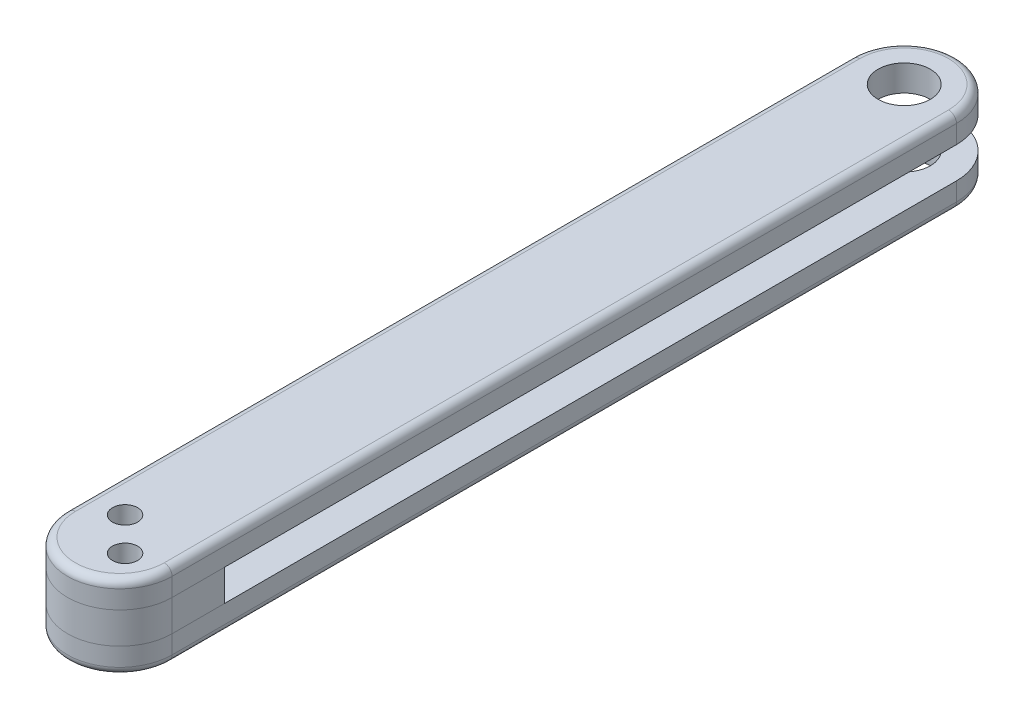
ISO-10303-21;
HEADER;
FILE_DESCRIPTION(('STEP AP214'),'2;1');
FILE_NAME('part.step','',(''),(''),'','','');
FILE_SCHEMA(('AUTOMOTIVE_DESIGN { 1 0 10303 214 1 1 1 1 }'));
ENDSEC;
DATA;
#1=APPLICATION_CONTEXT('core data for automotive mechanical design processes');
#2=APPLICATION_PROTOCOL_DEFINITION('international standard','automotive_design',2000,#1);
#3=PRODUCT_CONTEXT('',#1,'mechanical');
#4=PRODUCT('Part','Part','',(#3));
#5=PRODUCT_RELATED_PRODUCT_CATEGORY('part','',(#4));
#6=PRODUCT_DEFINITION_FORMATION('','',#4);
#7=PRODUCT_DEFINITION_CONTEXT('part definition',#1,'design');
#8=PRODUCT_DEFINITION('design','',#6,#7);
#9=PRODUCT_DEFINITION_SHAPE('','',#8);
#10=(LENGTH_UNIT() NAMED_UNIT(*) SI_UNIT(.MILLI.,.METRE.));
#11=(NAMED_UNIT(*) PLANE_ANGLE_UNIT() SI_UNIT($,.RADIAN.));
#12=(NAMED_UNIT(*) SI_UNIT($,.STERADIAN.) SOLID_ANGLE_UNIT());
#13=UNCERTAINTY_MEASURE_WITH_UNIT(LENGTH_MEASURE(1.E-05),#10,'distance_accuracy_value','');
#14=(GEOMETRIC_REPRESENTATION_CONTEXT(3) GLOBAL_UNCERTAINTY_ASSIGNED_CONTEXT((#13)) GLOBAL_UNIT_ASSIGNED_CONTEXT((#10,
#11,#12)) REPRESENTATION_CONTEXT('',''));
#15=CARTESIAN_POINT('',(0.,0.,0.));
#16=DIRECTION('',(0.,0.,1.));
#17=DIRECTION('',(1.,0.,0.));
#18=AXIS2_PLACEMENT_3D('',#15,#16,#17);
#19=CARTESIAN_POINT('',(-5.,-1.5,0.));
#20=DIRECTION('',(0.,-1.,0.));
#21=DIRECTION('',(0.,0.,-1.));
#22=AXIS2_PLACEMENT_3D('',#19,#20,#21);
#23=PLANE('',#22);
#24=DIRECTION('',(0.,0.,1.));
#25=VECTOR('',#24,1.);
#26=CARTESIAN_POINT('',(4.99999999999997,-1.5,0.));
#27=LINE('',#26,#25);
#28=CARTESIAN_POINT('',(4.99999999999999,-1.50000000002137,32.5));
#29=VERTEX_POINT('',#28);
#30=CARTESIAN_POINT('',(4.99999999999999,-1.5,37.5));
#31=VERTEX_POINT('',#30);
#32=EDGE_CURVE('E113',#29,#31,#27,.T.);
#33=ORIENTED_EDGE('',*,*,#32,.T.);
#34=CARTESIAN_POINT('',(0.,-1.5,37.5));
#35=DIRECTION('',(0.,-1.,0.));
#36=DIRECTION('',(0.,0.,-1.));
#37=AXIS2_PLACEMENT_3D('',#34,#35,#36);
#38=CIRCLE('',#37,4.99999999999998);
#39=CARTESIAN_POINT('',(-4.99999999999998,-1.5,37.5));
#40=VERTEX_POINT('',#39);
#41=EDGE_CURVE('E98',#31,#40,#38,.T.);
#42=ORIENTED_EDGE('',*,*,#41,.T.);
#43=DIRECTION('',(0.,0.,-1.));
#44=VECTOR('',#43,1.);
#45=CARTESIAN_POINT('',(-5.,-1.5,-37.5));
#46=LINE('',#45,#44);
#47=CARTESIAN_POINT('',(-4.99999999999545,-1.50000000002137,32.5));
#48=VERTEX_POINT('',#47);
#49=EDGE_CURVE('E132',#40,#48,#46,.T.);
#50=ORIENTED_EDGE('',*,*,#49,.T.);
#51=DIRECTION('',(-1.,0.,0.));
#52=VECTOR('',#51,1.);
#53=CARTESIAN_POINT('',(400000.,-1.50000000002137,32.5));
#54=LINE('',#53,#52);
#55=EDGE_CURVE('E59',#29,#48,#54,.T.);
#56=ORIENTED_EDGE('',*,*,#55,.F.);
#57=EDGE_LOOP('',(#33,#42,#50,#56));
#58=FACE_BOUND('',#57,.T.);
#59=CARTESIAN_POINT('',(1.59099025766973,-1.5,38.5909902576697));
#60=DIRECTION('',(0.,-1.,0.));
#61=DIRECTION('',(0.,0.,-1.));
#62=AXIS2_PLACEMENT_3D('',#59,#60,#61);
#63=CIRCLE('',#62,1.2);
#64=CARTESIAN_POINT('',(1.59099025766973,-1.5,37.3909902576697));
#65=VERTEX_POINT('',#64);
#66=EDGE_CURVE('E117',#65,#65,#63,.F.);
#67=ORIENTED_EDGE('',*,*,#66,.T.);
#68=EDGE_LOOP('',(#67));
#69=FACE_BOUND('',#68,.T.);
#70=CARTESIAN_POINT('',(-1.59099025766973,-1.5,35.4090097423302));
#71=DIRECTION('',(0.,-1.,0.));
#72=DIRECTION('',(0.,0.,-1.));
#73=AXIS2_PLACEMENT_3D('',#70,#71,#72);
#74=CIRCLE('',#73,1.2);
#75=CARTESIAN_POINT('',(-1.59099025766973,-1.5,34.2090097423302));
#76=VERTEX_POINT('',#75);
#77=EDGE_CURVE('E127',#76,#76,#74,.F.);
#78=ORIENTED_EDGE('',*,*,#77,.T.);
#79=EDGE_LOOP('',(#78));
#80=FACE_BOUND('',#79,.T.);
#81=ADVANCED_FACE('F55',(#58,#69,#80),#23,.T.);
#82=CARTESIAN_POINT('',(-5.,1.5,0.));
#83=DIRECTION('',(0.,1.,0.));
#84=DIRECTION('',(0.,0.,1.));
#85=AXIS2_PLACEMENT_3D('',#82,#83,#84);
#86=PLANE('',#85);
#87=CARTESIAN_POINT('',(0.,1.5,37.5));
#88=DIRECTION('',(0.,1.,0.));
#89=DIRECTION('',(0.,0.,1.));
#90=AXIS2_PLACEMENT_3D('',#87,#88,#89);
#91=CIRCLE('',#90,4.99999999999998);
#92=CARTESIAN_POINT('',(-4.99999999999998,1.5,37.5));
#93=VERTEX_POINT('',#92);
#94=CARTESIAN_POINT('',(4.99999999999999,1.5,37.5));
#95=VERTEX_POINT('',#94);
#96=EDGE_CURVE('E96',#93,#95,#91,.T.);
#97=ORIENTED_EDGE('',*,*,#96,.T.);
#98=DIRECTION('',(0.,0.,-1.));
#99=VECTOR('',#98,1.);
#100=CARTESIAN_POINT('',(4.99999999999997,1.5,-37.5));
#101=LINE('',#100,#99);
#102=CARTESIAN_POINT('',(4.99999999999545,1.50000000002137,32.5));
#103=VERTEX_POINT('',#102);
#104=EDGE_CURVE('E109',#95,#103,#101,.T.);
#105=ORIENTED_EDGE('',*,*,#104,.T.);
#106=DIRECTION('',(1.,0.,0.));
#107=VECTOR('',#106,1.);
#108=CARTESIAN_POINT('',(400000.,1.50000000002137,32.5));
#109=LINE('',#108,#107);
#110=CARTESIAN_POINT('',(-4.99999999999545,1.50000000002137,32.5));
#111=VERTEX_POINT('',#110);
#112=EDGE_CURVE('E65',#111,#103,#109,.T.);
#113=ORIENTED_EDGE('',*,*,#112,.F.);
#114=DIRECTION('',(0.,0.,1.));
#115=VECTOR('',#114,1.);
#116=CARTESIAN_POINT('',(-5.,1.5,-37.5));
#117=LINE('',#116,#115);
#118=EDGE_CURVE('E112',#111,#93,#117,.T.);
#119=ORIENTED_EDGE('',*,*,#118,.T.);
#120=EDGE_LOOP('',(#97,#105,#113,#119));
#121=FACE_BOUND('',#120,.T.);
#122=CARTESIAN_POINT('',(1.59099025766973,1.5,38.5909902576697));
#123=DIRECTION('',(0.,1.,0.));
#124=DIRECTION('',(0.,0.,1.));
#125=AXIS2_PLACEMENT_3D('',#122,#123,#124);
#126=CIRCLE('',#125,1.2);
#127=CARTESIAN_POINT('',(1.59099025766973,1.5,39.7909902576697));
#128=VERTEX_POINT('',#127);
#129=EDGE_CURVE('E121',#128,#128,#126,.F.);
#130=ORIENTED_EDGE('',*,*,#129,.T.);
#131=EDGE_LOOP('',(#130));
#132=FACE_BOUND('',#131,.T.);
#133=CARTESIAN_POINT('',(-1.59099025766973,1.5,35.4090097423302));
#134=DIRECTION('',(0.,1.,0.));
#135=DIRECTION('',(0.,0.,1.));
#136=AXIS2_PLACEMENT_3D('',#133,#134,#135);
#137=CIRCLE('',#136,1.2);
#138=CARTESIAN_POINT('',(-1.59099025766973,1.5,36.6090097423302));
#139=VERTEX_POINT('',#138);
#140=EDGE_CURVE('E128',#139,#139,#137,.F.);
#141=ORIENTED_EDGE('',*,*,#140,.T.);
#142=EDGE_LOOP('',(#141));
#143=FACE_BOUND('',#142,.T.);
#144=ADVANCED_FACE('F107',(#121,#132,#143),#86,.T.);
#145=CARTESIAN_POINT('',(-1.59099025766973,-4.,35.4090097423302));
#146=DIRECTION('',(0.,-1.,0.));
#147=DIRECTION('',(0.,0.,-1.));
#148=AXIS2_PLACEMENT_3D('',#145,#146,#147);
#149=CYLINDRICAL_SURFACE('',#148,1.2);
#150=ORIENTED_EDGE('',*,*,#140,.F.);
#151=EDGE_LOOP('',(#150));
#152=FACE_BOUND('',#151,.T.);
#153=ORIENTED_EDGE('',*,*,#77,.F.);
#154=EDGE_LOOP('',(#153));
#155=FACE_BOUND('',#154,.T.);
#156=ADVANCED_FACE('F149',(#152,#155),#149,.F.);
#157=CARTESIAN_POINT('',(1.59099025766973,-4.,38.5909902576697));
#158=DIRECTION('',(0.,-1.,0.));
#159=DIRECTION('',(0.,0.,-1.));
#160=AXIS2_PLACEMENT_3D('',#157,#158,#159);
#161=CYLINDRICAL_SURFACE('',#160,1.2);
#162=ORIENTED_EDGE('',*,*,#129,.F.);
#163=EDGE_LOOP('',(#162));
#164=FACE_BOUND('',#163,.T.);
#165=ORIENTED_EDGE('',*,*,#66,.F.);
#166=EDGE_LOOP('',(#165));
#167=FACE_BOUND('',#166,.T.);
#168=ADVANCED_FACE('F151',(#164,#167),#161,.F.);
#169=CARTESIAN_POINT('',(5.00000000000001,-5.01928464870704,32.5));
#170=DIRECTION('',(0.,0.,1.));
#171=DIRECTION('',(1.,0.,0.));
#172=AXIS2_PLACEMENT_3D('',#169,#170,#171);
#173=PLANE('',#172);
#174=ORIENTED_EDGE('',*,*,#55,.T.);
#175=DIRECTION('',(0.,1.,0.));
#176=VECTOR('',#175,1.);
#177=CARTESIAN_POINT('',(-4.99999999999545,-291595.6,32.5));
#178=LINE('',#177,#176);
#179=EDGE_CURVE('E12',#48,#111,#178,.T.);
#180=ORIENTED_EDGE('',*,*,#179,.T.);
#181=ORIENTED_EDGE('',*,*,#112,.T.);
#182=DIRECTION('',(0.,-1.,0.));
#183=VECTOR('',#182,1.);
#184=CARTESIAN_POINT('',(4.99999999999545,-291595.6,32.5));
#185=LINE('',#184,#183);
#186=EDGE_CURVE('E116',#103,#29,#185,.T.);
#187=ORIENTED_EDGE('',*,*,#186,.T.);
#188=EDGE_LOOP('',(#174,#180,#181,#187));
#189=FACE_BOUND('',#188,.T.);
#190=ADVANCED_FACE('F141',(#189),#173,.F.);
#191=CARTESIAN_POINT('',(4.99999999999997,4.,-37.5));
#192=DIRECTION('',(-1.,0.,0.));
#193=DIRECTION('',(0.,0.,1.));
#194=AXIS2_PLACEMENT_3D('',#191,#192,#193);
#195=PLANE('',#194);
#196=ORIENTED_EDGE('',*,*,#32,.F.);
#197=ORIENTED_EDGE('',*,*,#186,.F.);
#198=ORIENTED_EDGE('',*,*,#104,.F.);
#199=DIRECTION('',(0.,-1.,0.));
#200=VECTOR('',#199,1.);
#201=CARTESIAN_POINT('',(4.99999999999999,4.,37.5));
#202=LINE('',#201,#200);
#203=EDGE_CURVE('E93',#95,#31,#202,.T.);
#204=ORIENTED_EDGE('',*,*,#203,.T.);
#205=EDGE_LOOP('',(#196,#197,#198,#204));
#206=FACE_BOUND('',#205,.T.);
#207=ADVANCED_FACE('F115',(#206),#195,.F.);
#208=CARTESIAN_POINT('',(-5.,4.,-37.5));
#209=DIRECTION('',(1.,0.,0.));
#210=DIRECTION('',(0.,0.,-1.));
#211=AXIS2_PLACEMENT_3D('',#208,#209,#210);
#212=PLANE('',#211);
#213=ORIENTED_EDGE('',*,*,#49,.F.);
#214=DIRECTION('',(0.,-1.,0.));
#215=VECTOR('',#214,1.);
#216=CARTESIAN_POINT('',(-4.99999999999998,4.,37.5));
#217=LINE('',#216,#215);
#218=EDGE_CURVE('E103',#93,#40,#217,.T.);
#219=ORIENTED_EDGE('',*,*,#218,.F.);
#220=ORIENTED_EDGE('',*,*,#118,.F.);
#221=ORIENTED_EDGE('',*,*,#179,.F.);
#222=EDGE_LOOP('',(#213,#219,#220,#221));
#223=FACE_BOUND('',#222,.T.);
#224=ADVANCED_FACE('F57',(#223),#212,.F.);
#225=CARTESIAN_POINT('',(0.,4.,37.5));
#226=DIRECTION('',(0.,-1.,0.));
#227=DIRECTION('',(0.,0.,-1.));
#228=AXIS2_PLACEMENT_3D('',#225,#226,#227);
#229=CYLINDRICAL_SURFACE('',#228,4.99999999999998);
#230=ORIENTED_EDGE('',*,*,#41,.F.);
#231=ORIENTED_EDGE('',*,*,#203,.F.);
#232=ORIENTED_EDGE('',*,*,#96,.F.);
#233=ORIENTED_EDGE('',*,*,#218,.T.);
#234=EDGE_LOOP('',(#230,#231,#232,#233));
#235=FACE_BOUND('',#234,.T.);
#236=ADVANCED_FACE('F95',(#235),#229,.T.);
#237=CLOSED_SHELL('',(#81,#144,#156,#168,#190,#207,#224,#236));
#238=MANIFOLD_SOLID_BREP('B2',#237);
#239=CARTESIAN_POINT('',(-5.,-1.5,0.));
#240=DIRECTION('',(0.,-1.,0.));
#241=DIRECTION('',(0.,0.,-1.));
#242=AXIS2_PLACEMENT_3D('',#239,#240,#241);
#243=PLANE('',#242);
#244=CARTESIAN_POINT('',(-1.59099025766973,-1.5,35.4090097423302));
#245=DIRECTION('',(0.,-1.,0.));
#246=DIRECTION('',(0.,0.,-1.));
#247=AXIS2_PLACEMENT_3D('',#244,#245,#246);
#248=CIRCLE('',#247,1.2);
#249=CARTESIAN_POINT('',(-1.59099025766973,-1.5,34.2090097423302));
#250=VERTEX_POINT('',#249);
#251=EDGE_CURVE('E406',#250,#250,#248,.F.);
#252=ORIENTED_EDGE('',*,*,#251,.F.);
#253=EDGE_LOOP('',(#252));
#254=FACE_BOUND('',#253,.T.);
#255=CARTESIAN_POINT('',(1.59099025766973,-1.5,38.5909902576697));
#256=DIRECTION('',(0.,-1.,0.));
#257=DIRECTION('',(0.,0.,-1.));
#258=AXIS2_PLACEMENT_3D('',#255,#256,#257);
#259=CIRCLE('',#258,1.2);
#260=CARTESIAN_POINT('',(1.59099025766973,-1.5,37.3909902576697));
#261=VERTEX_POINT('',#260);
#262=EDGE_CURVE('E343',#261,#261,#259,.F.);
#263=ORIENTED_EDGE('',*,*,#262,.F.);
#264=EDGE_LOOP('',(#263));
#265=FACE_BOUND('',#264,.T.);
#266=CARTESIAN_POINT('',(0.,-1.5,37.5));
#267=DIRECTION('',(0.,-1.,0.));
#268=DIRECTION('',(0.,0.,-1.));
#269=AXIS2_PLACEMENT_3D('',#266,#267,#268);
#270=CIRCLE('',#269,4.99999999999998);
#271=CARTESIAN_POINT('',(4.99999999999999,-1.5,37.5));
#272=VERTEX_POINT('',#271);
#273=CARTESIAN_POINT('',(-4.99999999999998,-1.5,37.5));
#274=VERTEX_POINT('',#273);
#275=EDGE_CURVE('E327',#272,#274,#270,.T.);
#276=ORIENTED_EDGE('',*,*,#275,.F.);
#277=DIRECTION('',(0.,0.,-1.));
#278=VECTOR('',#277,1.);
#279=CARTESIAN_POINT('',(4.99999999999545,-1.50000000002137,52.9403065089141));
#280=LINE('',#279,#278);
#281=CARTESIAN_POINT('',(4.99999999999545,-1.50000000002137,-37.5));
#282=VERTEX_POINT('',#281);
#283=EDGE_CURVE('E334',#272,#282,#280,.T.);
#284=ORIENTED_EDGE('',*,*,#283,.T.);
#285=CARTESIAN_POINT('',(0.,-1.50000000002137,-37.5));
#286=DIRECTION('',(0.,-1.,0.));
#287=DIRECTION('',(0.,0.,-1.));
#288=AXIS2_PLACEMENT_3D('',#285,#286,#287);
#289=CIRCLE('',#288,4.99999999999998);
#290=CARTESIAN_POINT('',(-4.99999999999545,-1.50000000002137,-37.5));
#291=VERTEX_POINT('',#290);
#292=EDGE_CURVE('E329',#291,#282,#289,.T.);
#293=ORIENTED_EDGE('',*,*,#292,.F.);
#294=DIRECTION('',(0.,0.,-1.));
#295=VECTOR('',#294,1.);
#296=CARTESIAN_POINT('',(-4.99999999999545,-1.50000000002137,52.9403065089141));
#297=LINE('',#296,#295);
#298=EDGE_CURVE('E323',#274,#291,#297,.T.);
#299=ORIENTED_EDGE('',*,*,#298,.F.);
#300=EDGE_LOOP('',(#276,#284,#293,#299));
#301=FACE_BOUND('',#300,.T.);
#302=CARTESIAN_POINT('',(0.,-1.50000000002137,-37.5));
#303=DIRECTION('',(0.,-1.,0.));
#304=DIRECTION('',(0.,0.,-1.));
#305=AXIS2_PLACEMENT_3D('',#302,#303,#304);
#306=CIRCLE('',#305,2.5);
#307=CARTESIAN_POINT('',(0.,-1.50000000002137,-40.));
#308=VERTEX_POINT('',#307);
#309=EDGE_CURVE('E335',#308,#308,#306,.T.);
#310=ORIENTED_EDGE('',*,*,#309,.T.);
#311=EDGE_LOOP('',(#310));
#312=FACE_BOUND('',#311,.T.);
#313=ADVANCED_FACE('F241',(#254,#265,#301,#312),#243,.F.);
#314=CARTESIAN_POINT('',(-1.59099025766973,-2.,35.4090097423302));
#315=DIRECTION('',(0.,-1.,0.));
#316=DIRECTION('',(0.,0.,-1.));
#317=AXIS2_PLACEMENT_3D('',#314,#315,#316);
#318=CYLINDRICAL_SURFACE('',#317,2.2);
#319=CARTESIAN_POINT('',(-1.59099025766973,-4.,35.4090097423302));
#320=DIRECTION('',(0.,1.,0.));
#321=DIRECTION('',(0.,0.,1.));
#322=AXIS2_PLACEMENT_3D('',#319,#320,#321);
#323=CIRCLE('',#322,2.2);
#324=CARTESIAN_POINT('',(-0.0353553390593218,-4.,33.8533748237198));
#325=VERTEX_POINT('',#324);
#326=CARTESIAN_POINT('',(-3.14662517628013,-4.,36.9646446609406));
#327=VERTEX_POINT('',#326);
#328=EDGE_CURVE('E356',#325,#327,#323,.T.);
#329=ORIENTED_EDGE('',*,*,#328,.F.);
#330=DIRECTION('',(0.,-1.,0.));
#331=VECTOR('',#330,1.);
#332=CARTESIAN_POINT('',(-0.0353553390593218,-2.,33.8533748237198));
#333=LINE('',#332,#331);
#334=CARTESIAN_POINT('',(-0.0353553390593218,-2.,33.8533748237198));
#335=VERTEX_POINT('',#334);
#336=EDGE_CURVE('E281',#335,#325,#333,.T.);
#337=ORIENTED_EDGE('',*,*,#336,.F.);
#338=CARTESIAN_POINT('',(-1.59099025766973,-2.,35.4090097423302));
#339=DIRECTION('',(0.,1.,0.));
#340=DIRECTION('',(0.,0.,1.));
#341=AXIS2_PLACEMENT_3D('',#338,#339,#340);
#342=CIRCLE('',#341,2.2);
#343=CARTESIAN_POINT('',(-3.14662517628013,-2.,36.9646446609407));
#344=VERTEX_POINT('',#343);
#345=EDGE_CURVE('E361',#335,#344,#342,.T.);
#346=ORIENTED_EDGE('',*,*,#345,.T.);
#347=DIRECTION('',(0.,-1.,0.));
#348=VECTOR('',#347,1.);
#349=CARTESIAN_POINT('',(-3.14662517628013,-2.,36.9646446609407));
#350=LINE('',#349,#348);
#351=EDGE_CURVE('E371',#344,#327,#350,.T.);
#352=ORIENTED_EDGE('',*,*,#351,.T.);
#353=EDGE_LOOP('',(#329,#337,#346,#352));
#354=FACE_BOUND('',#353,.T.);
#355=ADVANCED_FACE('F423',(#354),#318,.F.);
#356=CARTESIAN_POINT('',(-38.8056349186104,-2.,1.30563491861026));
#357=DIRECTION('',(-0.707106781186549,0.,0.707106781186546));
#358=DIRECTION('',(0.707106781186546,0.,0.707106781186549));
#359=AXIS2_PLACEMENT_3D('',#356,#357,#358);
#360=PLANE('',#359);
#361=DIRECTION('',(-0.707106781186546,0.,-0.707106781186549));
#362=VECTOR('',#361,1.);
#363=CARTESIAN_POINT('',(-38.8056349186104,-4.,1.30563491861026));
#364=LINE('',#363,#362);
#365=CARTESIAN_POINT('',(0.0353553390593231,-4.,40.1466251762801));
#366=VERTEX_POINT('',#365);
#367=EDGE_CURVE('E366',#366,#327,#364,.T.);
#368=ORIENTED_EDGE('',*,*,#367,.T.);
#369=ORIENTED_EDGE('',*,*,#351,.F.);
#370=DIRECTION('',(-0.707106781186546,0.,-0.707106781186549));
#371=VECTOR('',#370,1.);
#372=CARTESIAN_POINT('',(-38.8056349186104,-2.,1.30563491861026));
#373=LINE('',#372,#371);
#374=CARTESIAN_POINT('',(0.0353553390593231,-2.,40.1466251762801));
#375=VERTEX_POINT('',#374);
#376=EDGE_CURVE('E358',#375,#344,#373,.T.);
#377=ORIENTED_EDGE('',*,*,#376,.F.);
#378=DIRECTION('',(0.,-1.,0.));
#379=VECTOR('',#378,1.);
#380=CARTESIAN_POINT('',(0.0353553390593231,-2.,40.1466251762801));
#381=LINE('',#380,#379);
#382=EDGE_CURVE('E275',#375,#366,#381,.T.);
#383=ORIENTED_EDGE('',*,*,#382,.T.);
#384=EDGE_LOOP('',(#368,#369,#377,#383));
#385=FACE_BOUND('',#384,.T.);
#386=ADVANCED_FACE('F430',(#385),#360,.F.);
#387=CARTESIAN_POINT('',(1.59099025766973,-2.,38.5909902576697));
#388=DIRECTION('',(0.,-1.,0.));
#389=DIRECTION('',(0.,0.,-1.));
#390=AXIS2_PLACEMENT_3D('',#387,#388,#389);
#391=CYLINDRICAL_SURFACE('',#390,2.2);
#392=CARTESIAN_POINT('',(1.59099025766973,-4.,38.5909902576697));
#393=DIRECTION('',(0.,-1.,0.));
#394=DIRECTION('',(0.,0.,-1.));
#395=AXIS2_PLACEMENT_3D('',#392,#393,#394);
#396=CIRCLE('',#395,2.2);
#397=CARTESIAN_POINT('',(3.14662517628013,-4.,37.0353553390593));
#398=VERTEX_POINT('',#397);
#399=EDGE_CURVE('E380',#398,#366,#396,.T.);
#400=ORIENTED_EDGE('',*,*,#399,.T.);
#401=ORIENTED_EDGE('',*,*,#382,.F.);
#402=CARTESIAN_POINT('',(1.59099025766973,-2.,38.5909902576697));
#403=DIRECTION('',(0.,1.,0.));
#404=DIRECTION('',(0.,0.,1.));
#405=AXIS2_PLACEMENT_3D('',#402,#403,#404);
#406=CIRCLE('',#405,2.2);
#407=CARTESIAN_POINT('',(3.14662517628013,-2.,37.0353553390593));
#408=VERTEX_POINT('',#407);
#409=EDGE_CURVE('E277',#375,#408,#406,.T.);
#410=ORIENTED_EDGE('',*,*,#409,.T.);
#411=DIRECTION('',(0.,-1.,0.));
#412=VECTOR('',#411,1.);
#413=CARTESIAN_POINT('',(3.14662517628013,-2.,37.0353553390593));
#414=LINE('',#413,#412);
#415=EDGE_CURVE('E260',#408,#398,#414,.T.);
#416=ORIENTED_EDGE('',*,*,#415,.T.);
#417=EDGE_LOOP('',(#400,#401,#410,#416));
#418=FACE_BOUND('',#417,.T.);
#419=ADVANCED_FACE('F470',(#418),#391,.F.);
#420=CARTESIAN_POINT('',(-35.6943650813896,-2.,-1.80563491861056));
#421=DIRECTION('',(0.707106781186549,0.,-0.707106781186546));
#422=DIRECTION('',(-0.707106781186546,0.,-0.707106781186549));
#423=AXIS2_PLACEMENT_3D('',#420,#421,#422);
#424=PLANE('',#423);
#425=DIRECTION('',(0.707106781186546,0.,0.707106781186549));
#426=VECTOR('',#425,1.);
#427=CARTESIAN_POINT('',(-35.6943650813896,-4.,-1.80563491861056));
#428=LINE('',#427,#426);
#429=EDGE_CURVE('E363',#325,#398,#428,.T.);
#430=ORIENTED_EDGE('',*,*,#429,.T.);
#431=ORIENTED_EDGE('',*,*,#415,.F.);
#432=DIRECTION('',(0.707106781186546,0.,0.707106781186549));
#433=VECTOR('',#432,1.);
#434=CARTESIAN_POINT('',(-35.6943650813896,-2.,-1.80563491861056));
#435=LINE('',#434,#433);
#436=EDGE_CURVE('E353',#335,#408,#435,.T.);
#437=ORIENTED_EDGE('',*,*,#436,.F.);
#438=ORIENTED_EDGE('',*,*,#336,.T.);
#439=EDGE_LOOP('',(#430,#431,#437,#438));
#440=FACE_BOUND('',#439,.T.);
#441=ADVANCED_FACE('F465',(#440),#424,.F.);
#442=CARTESIAN_POINT('',(1.59099025766973,-2.,38.5909902576697));
#443=DIRECTION('',(0.,1.,0.));
#444=DIRECTION('',(0.,0.,1.));
#445=AXIS2_PLACEMENT_3D('',#442,#443,#444);
#446=PLANE('',#445);
#447=CARTESIAN_POINT('',(-1.59099025766973,-2.,35.4090097423302));
#448=DIRECTION('',(0.,1.,0.));
#449=DIRECTION('',(0.,0.,1.));
#450=AXIS2_PLACEMENT_3D('',#447,#448,#449);
#451=CIRCLE('',#450,1.2);
#452=CARTESIAN_POINT('',(-1.59099025766973,-2.,36.6090097423302));
#453=VERTEX_POINT('',#452);
#454=EDGE_CURVE('E372',#453,#453,#451,.F.);
#455=ORIENTED_EDGE('',*,*,#454,.F.);
#456=EDGE_LOOP('',(#455));
#457=FACE_BOUND('',#456,.T.);
#458=ORIENTED_EDGE('',*,*,#436,.T.);
#459=ORIENTED_EDGE('',*,*,#409,.F.);
#460=ORIENTED_EDGE('',*,*,#376,.T.);
#461=ORIENTED_EDGE('',*,*,#345,.F.);
#462=EDGE_LOOP('',(#458,#459,#460,#461));
#463=FACE_BOUND('',#462,.T.);
#464=CARTESIAN_POINT('',(1.59099025766973,-2.,38.5909902576697));
#465=DIRECTION('',(0.,1.,0.));
#466=DIRECTION('',(0.,0.,1.));
#467=AXIS2_PLACEMENT_3D('',#464,#465,#466);
#468=CIRCLE('',#467,1.2);
#469=CARTESIAN_POINT('',(1.59099025766973,-2.,39.7909902576697));
#470=VERTEX_POINT('',#469);
#471=EDGE_CURVE('E377',#470,#470,#468,.F.);
#472=ORIENTED_EDGE('',*,*,#471,.F.);
#473=EDGE_LOOP('',(#472));
#474=FACE_BOUND('',#473,.T.);
#475=ADVANCED_FACE('F452',(#457,#463,#474),#446,.F.);
#476=CARTESIAN_POINT('',(-1.59099025766973,-4.,35.4090097423302));
#477=DIRECTION('',(0.,-1.,0.));
#478=DIRECTION('',(0.,0.,-1.));
#479=AXIS2_PLACEMENT_3D('',#476,#477,#478);
#480=CYLINDRICAL_SURFACE('',#479,1.2);
#481=ORIENTED_EDGE('',*,*,#251,.T.);
#482=EDGE_LOOP('',(#481));
#483=FACE_BOUND('',#482,.T.);
#484=ORIENTED_EDGE('',*,*,#454,.T.);
#485=EDGE_LOOP('',(#484));
#486=FACE_BOUND('',#485,.T.);
#487=ADVANCED_FACE('F449',(#483,#486),#480,.F.);
#488=CARTESIAN_POINT('',(1.59099025766973,-4.,38.5909902576697));
#489=DIRECTION('',(0.,-1.,0.));
#490=DIRECTION('',(0.,0.,-1.));
#491=AXIS2_PLACEMENT_3D('',#488,#489,#490);
#492=CYLINDRICAL_SURFACE('',#491,1.2);
#493=ORIENTED_EDGE('',*,*,#262,.T.);
#494=EDGE_LOOP('',(#493));
#495=FACE_BOUND('',#494,.T.);
#496=ORIENTED_EDGE('',*,*,#471,.T.);
#497=EDGE_LOOP('',(#496));
#498=FACE_BOUND('',#497,.T.);
#499=ADVANCED_FACE('F419',(#495,#498),#492,.F.);
#500=CARTESIAN_POINT('',(0.,-4.,-37.5));
#501=DIRECTION('',(0.,1.,0.));
#502=DIRECTION('',(0.,0.,1.));
#503=AXIS2_PLACEMENT_3D('',#500,#501,#502);
#504=PLANE('',#503);
#505=DIRECTION('',(0.,0.,1.));
#506=VECTOR('',#505,1.);
#507=CARTESIAN_POINT('',(-4.25,-4.,-37.5));
#508=LINE('',#507,#506);
#509=CARTESIAN_POINT('',(-4.24999999999998,-4.,37.5));
#510=VERTEX_POINT('',#509);
#511=CARTESIAN_POINT('',(-4.25,-4.,-37.5));
#512=VERTEX_POINT('',#511);
#513=EDGE_CURVE('E397',#510,#512,#508,.F.);
#514=ORIENTED_EDGE('',*,*,#513,.T.);
#515=CARTESIAN_POINT('',(0.,-4.,-37.5));
#516=DIRECTION('',(0.,1.,0.));
#517=DIRECTION('',(0.,0.,1.));
#518=AXIS2_PLACEMENT_3D('',#515,#516,#517);
#519=CIRCLE('',#518,4.24999999999998);
#520=CARTESIAN_POINT('',(4.24999999999997,-4.,-37.5));
#521=VERTEX_POINT('',#520);
#522=EDGE_CURVE('E403',#512,#521,#519,.F.);
#523=ORIENTED_EDGE('',*,*,#522,.T.);
#524=DIRECTION('',(0.,0.,-1.));
#525=VECTOR('',#524,1.);
#526=CARTESIAN_POINT('',(4.24999999999997,-4.,-37.5));
#527=LINE('',#526,#525);
#528=CARTESIAN_POINT('',(4.24999999999999,-4.,37.5));
#529=VERTEX_POINT('',#528);
#530=EDGE_CURVE('E401',#521,#529,#527,.F.);
#531=ORIENTED_EDGE('',*,*,#530,.T.);
#532=CARTESIAN_POINT('',(0.,-4.,37.5));
#533=DIRECTION('',(0.,1.,0.));
#534=DIRECTION('',(0.,0.,1.));
#535=AXIS2_PLACEMENT_3D('',#532,#533,#534);
#536=CIRCLE('',#535,4.24999999999998);
#537=EDGE_CURVE('E399',#529,#510,#536,.F.);
#538=ORIENTED_EDGE('',*,*,#537,.T.);
#539=EDGE_LOOP('',(#514,#523,#531,#538));
#540=FACE_BOUND('',#539,.T.);
#541=ORIENTED_EDGE('',*,*,#399,.F.);
#542=ORIENTED_EDGE('',*,*,#429,.F.);
#543=ORIENTED_EDGE('',*,*,#328,.T.);
#544=ORIENTED_EDGE('',*,*,#367,.F.);
#545=EDGE_LOOP('',(#541,#542,#543,#544));
#546=FACE_BOUND('',#545,.T.);
#547=CARTESIAN_POINT('',(0.,-4.,-37.5));
#548=DIRECTION('',(0.,1.,0.));
#549=DIRECTION('',(0.,0.,1.));
#550=AXIS2_PLACEMENT_3D('',#547,#548,#549);
#551=CIRCLE('',#550,2.5);
#552=CARTESIAN_POINT('',(0.,-4.,-35.));
#553=VERTEX_POINT('',#552);
#554=EDGE_CURVE('E384',#553,#553,#551,.T.);
#555=ORIENTED_EDGE('',*,*,#554,.T.);
#556=EDGE_LOOP('',(#555));
#557=FACE_BOUND('',#556,.T.);
#558=ADVANCED_FACE('F448',(#540,#546,#557),#504,.F.);
#559=CARTESIAN_POINT('',(0.,4.,-37.5));
#560=DIRECTION('',(0.,-1.,0.));
#561=DIRECTION('',(0.,0.,-1.));
#562=AXIS2_PLACEMENT_3D('',#559,#560,#561);
#563=CYLINDRICAL_SURFACE('',#562,2.5);
#564=ORIENTED_EDGE('',*,*,#309,.F.);
#565=EDGE_LOOP('',(#564));
#566=FACE_BOUND('',#565,.T.);
#567=ORIENTED_EDGE('',*,*,#554,.F.);
#568=EDGE_LOOP('',(#567));
#569=FACE_BOUND('',#568,.T.);
#570=ADVANCED_FACE('F454',(#566,#569),#563,.F.);
#571=CARTESIAN_POINT('',(0.,-3.25,37.5));
#572=DIRECTION('',(0.,1.,0.));
#573=DIRECTION('',(0.,0.,1.));
#574=AXIS2_PLACEMENT_3D('',#571,#572,#573);
#575=TOROIDAL_SURFACE('',#574,4.24999999999998,0.75);
#576=CARTESIAN_POINT('',(-4.24999999999998,-3.25,37.5));
#577=DIRECTION('',(0.,0.,-1.));
#578=DIRECTION('',(-1.,0.,0.));
#579=AXIS2_PLACEMENT_3D('',#576,#577,#578);
#580=CIRCLE('',#579,0.75);
#581=CARTESIAN_POINT('',(-4.99999999999998,-3.25,37.5));
#582=VERTEX_POINT('',#581);
#583=EDGE_CURVE('E409',#510,#582,#580,.T.);
#584=ORIENTED_EDGE('',*,*,#583,.F.);
#585=ORIENTED_EDGE('',*,*,#537,.F.);
#586=CARTESIAN_POINT('',(4.24999999999999,-3.25,37.5));
#587=DIRECTION('',(0.,0.,-1.));
#588=DIRECTION('',(-1.,0.,0.));
#589=AXIS2_PLACEMENT_3D('',#586,#587,#588);
#590=CIRCLE('',#589,0.75);
#591=CARTESIAN_POINT('',(4.99999999999999,-3.25,37.5));
#592=VERTEX_POINT('',#591);
#593=EDGE_CURVE('E365',#592,#529,#590,.T.);
#594=ORIENTED_EDGE('',*,*,#593,.F.);
#595=CARTESIAN_POINT('',(0.,-3.25,37.5));
#596=DIRECTION('',(0.,1.,0.));
#597=DIRECTION('',(0.,0.,1.));
#598=AXIS2_PLACEMENT_3D('',#595,#596,#597);
#599=CIRCLE('',#598,4.99999999999998);
#600=EDGE_CURVE('E392',#582,#592,#599,.T.);
#601=ORIENTED_EDGE('',*,*,#600,.F.);
#602=EDGE_LOOP('',(#584,#585,#594,#601));
#603=FACE_BOUND('',#602,.T.);
#604=ADVANCED_FACE('F457',(#603),#575,.T.);
#605=CARTESIAN_POINT('',(0.,-3.25,-37.5));
#606=DIRECTION('',(0.,1.,0.));
#607=DIRECTION('',(0.,0.,1.));
#608=AXIS2_PLACEMENT_3D('',#605,#606,#607);
#609=TOROIDAL_SURFACE('',#608,4.24999999999998,0.75);
#610=CARTESIAN_POINT('',(4.24999999999997,-3.25,-37.5));
#611=DIRECTION('',(0.,0.,-1.));
#612=DIRECTION('',(-1.,0.,0.));
#613=AXIS2_PLACEMENT_3D('',#610,#611,#612);
#614=CIRCLE('',#613,0.75);
#615=CARTESIAN_POINT('',(4.99999999999997,-3.25,-37.5));
#616=VERTEX_POINT('',#615);
#617=EDGE_CURVE('E251',#616,#521,#614,.T.);
#618=ORIENTED_EDGE('',*,*,#617,.T.);
#619=ORIENTED_EDGE('',*,*,#522,.F.);
#620=CARTESIAN_POINT('',(-4.25,-3.25,-37.5));
#621=DIRECTION('',(0.,0.,-1.));
#622=DIRECTION('',(-1.,0.,0.));
#623=AXIS2_PLACEMENT_3D('',#620,#621,#622);
#624=CIRCLE('',#623,0.75);
#625=CARTESIAN_POINT('',(-5.,-3.25,-37.5));
#626=VERTEX_POINT('',#625);
#627=EDGE_CURVE('E53',#512,#626,#624,.T.);
#628=ORIENTED_EDGE('',*,*,#627,.T.);
#629=CARTESIAN_POINT('',(0.,-3.25,-37.5));
#630=DIRECTION('',(0.,1.,0.));
#631=DIRECTION('',(0.,0.,1.));
#632=AXIS2_PLACEMENT_3D('',#629,#630,#631);
#633=CIRCLE('',#632,4.99999999999998);
#634=EDGE_CURVE('E394',#616,#626,#633,.T.);
#635=ORIENTED_EDGE('',*,*,#634,.F.);
#636=EDGE_LOOP('',(#618,#619,#628,#635));
#637=FACE_BOUND('',#636,.T.);
#638=ADVANCED_FACE('F479',(#637),#609,.T.);
#639=CARTESIAN_POINT('',(-4.25,-3.25,-37.5));
#640=DIRECTION('',(0.,0.,1.));
#641=DIRECTION('',(1.,0.,0.));
#642=AXIS2_PLACEMENT_3D('',#639,#640,#641);
#643=CYLINDRICAL_SURFACE('',#642,0.75);
#644=ORIENTED_EDGE('',*,*,#583,.T.);
#645=DIRECTION('',(0.,0.,1.));
#646=VECTOR('',#645,1.);
#647=CARTESIAN_POINT('',(-5.,-3.25,-37.5));
#648=LINE('',#647,#646);
#649=EDGE_CURVE('E346',#626,#582,#648,.T.);
#650=ORIENTED_EDGE('',*,*,#649,.F.);
#651=ORIENTED_EDGE('',*,*,#627,.F.);
#652=ORIENTED_EDGE('',*,*,#513,.F.);
#653=EDGE_LOOP('',(#644,#650,#651,#652));
#654=FACE_BOUND('',#653,.T.);
#655=ADVANCED_FACE('F462',(#654),#643,.T.);
#656=CARTESIAN_POINT('',(0.,4.,-37.5));
#657=DIRECTION('',(0.,-1.,0.));
#658=DIRECTION('',(0.,0.,-1.));
#659=AXIS2_PLACEMENT_3D('',#656,#657,#658);
#660=CYLINDRICAL_SURFACE('',#659,4.99999999999998);
#661=DIRECTION('',(0.,-1.,0.));
#662=VECTOR('',#661,1.);
#663=CARTESIAN_POINT('',(4.99999999999997,4.,-37.5));
#664=LINE('',#663,#662);
#665=EDGE_CURVE('E245',#282,#616,#664,.T.);
#666=ORIENTED_EDGE('',*,*,#665,.T.);
#667=ORIENTED_EDGE('',*,*,#634,.T.);
#668=DIRECTION('',(0.,-1.,0.));
#669=VECTOR('',#668,1.);
#670=CARTESIAN_POINT('',(-5.,4.,-37.5));
#671=LINE('',#670,#669);
#672=EDGE_CURVE('E348',#291,#626,#671,.T.);
#673=ORIENTED_EDGE('',*,*,#672,.F.);
#674=ORIENTED_EDGE('',*,*,#292,.T.);
#675=EDGE_LOOP('',(#666,#667,#673,#674));
#676=FACE_BOUND('',#675,.T.);
#677=ADVANCED_FACE('F459',(#676),#660,.T.);
#678=CARTESIAN_POINT('',(4.24999999999997,-3.25,-37.5));
#679=DIRECTION('',(0.,0.,-1.));
#680=DIRECTION('',(-1.,0.,0.));
#681=AXIS2_PLACEMENT_3D('',#678,#679,#680);
#682=CYLINDRICAL_SURFACE('',#681,0.75);
#683=ORIENTED_EDGE('',*,*,#593,.T.);
#684=ORIENTED_EDGE('',*,*,#530,.F.);
#685=ORIENTED_EDGE('',*,*,#617,.F.);
#686=DIRECTION('',(0.,0.,-1.));
#687=VECTOR('',#686,1.);
#688=CARTESIAN_POINT('',(4.99999999999997,-3.25,-37.5));
#689=LINE('',#688,#687);
#690=EDGE_CURVE('E350',#592,#616,#689,.T.);
#691=ORIENTED_EDGE('',*,*,#690,.F.);
#692=EDGE_LOOP('',(#683,#684,#685,#691));
#693=FACE_BOUND('',#692,.T.);
#694=ADVANCED_FACE('F443',(#693),#682,.T.);
#695=CARTESIAN_POINT('',(0.,4.,37.5));
#696=DIRECTION('',(0.,-1.,0.));
#697=DIRECTION('',(0.,0.,-1.));
#698=AXIS2_PLACEMENT_3D('',#695,#696,#697);
#699=CYLINDRICAL_SURFACE('',#698,4.99999999999998);
#700=DIRECTION('',(0.,-1.,0.));
#701=VECTOR('',#700,1.);
#702=CARTESIAN_POINT('',(4.99999999999999,4.,37.5));
#703=LINE('',#702,#701);
#704=EDGE_CURVE('E342',#272,#592,#703,.T.);
#705=ORIENTED_EDGE('',*,*,#704,.F.);
#706=ORIENTED_EDGE('',*,*,#275,.T.);
#707=DIRECTION('',(0.,-1.,0.));
#708=VECTOR('',#707,1.);
#709=CARTESIAN_POINT('',(-4.99999999999998,4.,37.5));
#710=LINE('',#709,#708);
#711=EDGE_CURVE('E340',#274,#582,#710,.T.);
#712=ORIENTED_EDGE('',*,*,#711,.T.);
#713=ORIENTED_EDGE('',*,*,#600,.T.);
#714=EDGE_LOOP('',(#705,#706,#712,#713));
#715=FACE_BOUND('',#714,.T.);
#716=ADVANCED_FACE('F338',(#715),#699,.T.);
#717=CARTESIAN_POINT('',(4.99999999999997,4.,-37.5));
#718=DIRECTION('',(-1.,0.,0.));
#719=DIRECTION('',(0.,0.,1.));
#720=AXIS2_PLACEMENT_3D('',#717,#718,#719);
#721=PLANE('',#720);
#722=ORIENTED_EDGE('',*,*,#283,.F.);
#723=ORIENTED_EDGE('',*,*,#704,.T.);
#724=ORIENTED_EDGE('',*,*,#690,.T.);
#725=ORIENTED_EDGE('',*,*,#665,.F.);
#726=EDGE_LOOP('',(#722,#723,#724,#725));
#727=FACE_BOUND('',#726,.T.);
#728=ADVANCED_FACE('F436',(#727),#721,.F.);
#729=CARTESIAN_POINT('',(-5.,4.,-37.5));
#730=DIRECTION('',(1.,0.,0.));
#731=DIRECTION('',(0.,0.,-1.));
#732=AXIS2_PLACEMENT_3D('',#729,#730,#731);
#733=PLANE('',#732);
#734=ORIENTED_EDGE('',*,*,#711,.F.);
#735=ORIENTED_EDGE('',*,*,#298,.T.);
#736=ORIENTED_EDGE('',*,*,#672,.T.);
#737=ORIENTED_EDGE('',*,*,#649,.T.);
#738=EDGE_LOOP('',(#734,#735,#736,#737));
#739=FACE_BOUND('',#738,.T.);
#740=ADVANCED_FACE('F243',(#739),#733,.F.);
#741=CLOSED_SHELL('',(#313,#355,#386,#419,#441,#475,#487,#499,#558,#570,#604,#638,#655,#677,
#694,#716,#728,#740));
#742=MANIFOLD_SOLID_BREP('B6',#741);
#743=CARTESIAN_POINT('',(0.,3.25,37.5));
#744=DIRECTION('',(0.,1.,0.));
#745=DIRECTION('',(0.,0.,1.));
#746=AXIS2_PLACEMENT_3D('',#743,#744,#745);
#747=TOROIDAL_SURFACE('',#746,4.24999999999998,0.75);
#748=CARTESIAN_POINT('',(-4.24999999999998,3.25,37.5));
#749=DIRECTION('',(0.,0.,-1.));
#750=DIRECTION('',(-1.,0.,0.));
#751=AXIS2_PLACEMENT_3D('',#748,#749,#750);
#752=CIRCLE('',#751,0.75);
#753=CARTESIAN_POINT('',(-4.99999999999998,3.25,37.5));
#754=VERTEX_POINT('',#753);
#755=CARTESIAN_POINT('',(-4.24999999999998,4.,37.5));
#756=VERTEX_POINT('',#755);
#757=EDGE_CURVE('E769',#754,#756,#752,.T.);
#758=ORIENTED_EDGE('',*,*,#757,.F.);
#759=CARTESIAN_POINT('',(0.,3.25,37.5));
#760=DIRECTION('',(0.,1.,0.));
#761=DIRECTION('',(0.,0.,1.));
#762=AXIS2_PLACEMENT_3D('',#759,#760,#761);
#763=CIRCLE('',#762,4.99999999999998);
#764=CARTESIAN_POINT('',(4.99999999999999,3.25,37.5));
#765=VERTEX_POINT('',#764);
#766=EDGE_CURVE('E761',#765,#754,#763,.F.);
#767=ORIENTED_EDGE('',*,*,#766,.F.);
#768=CARTESIAN_POINT('',(4.24999999999999,3.25,37.5));
#769=DIRECTION('',(0.,0.,-1.));
#770=DIRECTION('',(-1.,0.,0.));
#771=AXIS2_PLACEMENT_3D('',#768,#769,#770);
#772=CIRCLE('',#771,0.75);
#773=CARTESIAN_POINT('',(4.24999999999999,4.,37.5));
#774=VERTEX_POINT('',#773);
#775=EDGE_CURVE('E772',#774,#765,#772,.T.);
#776=ORIENTED_EDGE('',*,*,#775,.F.);
#777=CARTESIAN_POINT('',(0.,4.,37.5));
#778=DIRECTION('',(0.,1.,0.));
#779=DIRECTION('',(0.,0.,1.));
#780=AXIS2_PLACEMENT_3D('',#777,#778,#779);
#781=CIRCLE('',#780,4.24999999999998);
#782=EDGE_CURVE('E750',#756,#774,#781,.T.);
#783=ORIENTED_EDGE('',*,*,#782,.F.);
#784=EDGE_LOOP('',(#758,#767,#776,#783));
#785=FACE_BOUND('',#784,.T.);
#786=ADVANCED_FACE('F661',(#785),#747,.T.);
#787=CARTESIAN_POINT('',(0.,3.25,-37.5));
#788=DIRECTION('',(0.,1.,0.));
#789=DIRECTION('',(0.,0.,1.));
#790=AXIS2_PLACEMENT_3D('',#787,#788,#789);
#791=TOROIDAL_SURFACE('',#790,4.24999999999998,0.75);
#792=CARTESIAN_POINT('',(4.24999999999997,3.25,-37.5));
#793=DIRECTION('',(0.,0.,-1.));
#794=DIRECTION('',(-1.,0.,0.));
#795=AXIS2_PLACEMENT_3D('',#792,#793,#794);
#796=CIRCLE('',#795,0.75);
#797=CARTESIAN_POINT('',(4.24999999999997,4.,-37.5));
#798=VERTEX_POINT('',#797);
#799=CARTESIAN_POINT('',(4.99999999999997,3.25,-37.5));
#800=VERTEX_POINT('',#799);
#801=EDGE_CURVE('E767',#798,#800,#796,.T.);
#802=ORIENTED_EDGE('',*,*,#801,.T.);
#803=CARTESIAN_POINT('',(0.,3.25,-37.5));
#804=DIRECTION('',(0.,1.,0.));
#805=DIRECTION('',(0.,0.,1.));
#806=AXIS2_PLACEMENT_3D('',#803,#804,#805);
#807=CIRCLE('',#806,4.99999999999998);
#808=CARTESIAN_POINT('',(-5.,3.25,-37.5));
#809=VERTEX_POINT('',#808);
#810=EDGE_CURVE('E757',#809,#800,#807,.F.);
#811=ORIENTED_EDGE('',*,*,#810,.F.);
#812=CARTESIAN_POINT('',(-4.25,3.25,-37.5));
#813=DIRECTION('',(0.,0.,-1.));
#814=DIRECTION('',(-1.,0.,0.));
#815=AXIS2_PLACEMENT_3D('',#812,#813,#814);
#816=CIRCLE('',#815,0.75);
#817=CARTESIAN_POINT('',(-4.25,4.,-37.5));
#818=VERTEX_POINT('',#817);
#819=EDGE_CURVE('E765',#809,#818,#816,.T.);
#820=ORIENTED_EDGE('',*,*,#819,.T.);
#821=CARTESIAN_POINT('',(0.,4.,-37.5));
#822=DIRECTION('',(0.,1.,0.));
#823=DIRECTION('',(0.,0.,1.));
#824=AXIS2_PLACEMENT_3D('',#821,#822,#823);
#825=CIRCLE('',#824,4.24999999999998);
#826=EDGE_CURVE('E754',#798,#818,#825,.T.);
#827=ORIENTED_EDGE('',*,*,#826,.F.);
#828=EDGE_LOOP('',(#802,#811,#820,#827));
#829=FACE_BOUND('',#828,.T.);
#830=ADVANCED_FACE('F794',(#829),#791,.T.);
#831=CARTESIAN_POINT('',(4.24999999999997,3.25,-37.5));
#832=DIRECTION('',(0.,0.,1.));
#833=DIRECTION('',(1.,0.,0.));
#834=AXIS2_PLACEMENT_3D('',#831,#832,#833);
#835=CYLINDRICAL_SURFACE('',#834,0.75);
#836=ORIENTED_EDGE('',*,*,#775,.T.);
#837=DIRECTION('',(0.,0.,-1.));
#838=VECTOR('',#837,1.);
#839=CARTESIAN_POINT('',(4.99999999999999,3.25,37.5));
#840=LINE('',#839,#838);
#841=EDGE_CURVE('E759',#800,#765,#840,.F.);
#842=ORIENTED_EDGE('',*,*,#841,.F.);
#843=ORIENTED_EDGE('',*,*,#801,.F.);
#844=DIRECTION('',(0.,0.,-1.));
#845=VECTOR('',#844,1.);
#846=CARTESIAN_POINT('',(4.24999999999997,4.,-37.5));
#847=LINE('',#846,#845);
#848=EDGE_CURVE('E752',#774,#798,#847,.T.);
#849=ORIENTED_EDGE('',*,*,#848,.F.);
#850=EDGE_LOOP('',(#836,#842,#843,#849));
#851=FACE_BOUND('',#850,.T.);
#852=ADVANCED_FACE('F800',(#851),#835,.T.);
#853=CARTESIAN_POINT('',(0.,4.,-37.5));
#854=DIRECTION('',(0.,-1.,0.));
#855=DIRECTION('',(0.,0.,-1.));
#856=AXIS2_PLACEMENT_3D('',#853,#854,#855);
#857=CYLINDRICAL_SURFACE('',#856,4.99999999999998);
#858=DIRECTION('',(0.,-1.,0.));
#859=VECTOR('',#858,1.);
#860=CARTESIAN_POINT('',(-5.,4.,-37.5));
#861=LINE('',#860,#859);
#862=CARTESIAN_POINT('',(-4.99999999999545,1.50000000002137,-37.5));
#863=VERTEX_POINT('',#862);
#864=EDGE_CURVE('E717',#809,#863,#861,.T.);
#865=ORIENTED_EDGE('',*,*,#864,.F.);
#866=ORIENTED_EDGE('',*,*,#810,.T.);
#867=DIRECTION('',(0.,-1.,0.));
#868=VECTOR('',#867,1.);
#869=CARTESIAN_POINT('',(4.99999999999997,4.,-37.5));
#870=LINE('',#869,#868);
#871=CARTESIAN_POINT('',(4.99999999999545,1.50000000002137,-37.5));
#872=VERTEX_POINT('',#871);
#873=EDGE_CURVE('E720',#800,#872,#870,.T.);
#874=ORIENTED_EDGE('',*,*,#873,.T.);
#875=CARTESIAN_POINT('',(0.,1.50000000002137,-37.5));
#876=DIRECTION('',(0.,1.,0.));
#877=DIRECTION('',(0.,0.,1.));
#878=AXIS2_PLACEMENT_3D('',#875,#876,#877);
#879=CIRCLE('',#878,4.99999999999998);
#880=EDGE_CURVE('E714',#872,#863,#879,.T.);
#881=ORIENTED_EDGE('',*,*,#880,.T.);
#882=EDGE_LOOP('',(#865,#866,#874,#881));
#883=FACE_BOUND('',#882,.T.);
#884=ADVANCED_FACE('F715',(#883),#857,.T.);
#885=CARTESIAN_POINT('',(-4.25,3.25,-37.5));
#886=DIRECTION('',(0.,0.,-1.));
#887=DIRECTION('',(-1.,0.,0.));
#888=AXIS2_PLACEMENT_3D('',#885,#886,#887);
#889=CYLINDRICAL_SURFACE('',#888,0.75);
#890=ORIENTED_EDGE('',*,*,#757,.T.);
#891=DIRECTION('',(0.,0.,1.));
#892=VECTOR('',#891,1.);
#893=CARTESIAN_POINT('',(-4.24999999999998,4.,37.5));
#894=LINE('',#893,#892);
#895=EDGE_CURVE('E727',#818,#756,#894,.T.);
#896=ORIENTED_EDGE('',*,*,#895,.F.);
#897=ORIENTED_EDGE('',*,*,#819,.F.);
#898=DIRECTION('',(0.,0.,1.));
#899=VECTOR('',#898,1.);
#900=CARTESIAN_POINT('',(-5.,3.25,-37.5));
#901=LINE('',#900,#899);
#902=EDGE_CURVE('E726',#754,#809,#901,.F.);
#903=ORIENTED_EDGE('',*,*,#902,.F.);
#904=EDGE_LOOP('',(#890,#896,#897,#903));
#905=FACE_BOUND('',#904,.T.);
#906=ADVANCED_FACE('F810',(#905),#889,.T.);
#907=CARTESIAN_POINT('',(0.,4.,37.5));
#908=DIRECTION('',(0.,-1.,0.));
#909=DIRECTION('',(0.,0.,-1.));
#910=AXIS2_PLACEMENT_3D('',#907,#908,#909);
#911=CYLINDRICAL_SURFACE('',#910,4.99999999999998);
#912=CARTESIAN_POINT('',(0.,1.5,37.5));
#913=DIRECTION('',(0.,1.,0.));
#914=DIRECTION('',(0.,0.,1.));
#915=AXIS2_PLACEMENT_3D('',#912,#913,#914);
#916=CIRCLE('',#915,4.99999999999998);
#917=CARTESIAN_POINT('',(-4.99999999999998,1.5,37.5));
#918=VERTEX_POINT('',#917);
#919=CARTESIAN_POINT('',(4.99999999999999,1.5,37.5));
#920=VERTEX_POINT('',#919);
#921=EDGE_CURVE('E239',#918,#920,#916,.T.);
#922=ORIENTED_EDGE('',*,*,#921,.T.);
#923=DIRECTION('',(0.,-1.,0.));
#924=VECTOR('',#923,1.);
#925=CARTESIAN_POINT('',(4.99999999999999,4.,37.5));
#926=LINE('',#925,#924);
#927=EDGE_CURVE('E743',#765,#920,#926,.T.);
#928=ORIENTED_EDGE('',*,*,#927,.F.);
#929=ORIENTED_EDGE('',*,*,#766,.T.);
#930=DIRECTION('',(0.,-1.,0.));
#931=VECTOR('',#930,1.);
#932=CARTESIAN_POINT('',(-4.99999999999998,4.,37.5));
#933=LINE('',#932,#931);
#934=EDGE_CURVE('E728',#754,#918,#933,.T.);
#935=ORIENTED_EDGE('',*,*,#934,.T.);
#936=EDGE_LOOP('',(#922,#928,#929,#935));
#937=FACE_BOUND('',#936,.T.);
#938=ADVANCED_FACE('F818',(#937),#911,.T.);
#939=CARTESIAN_POINT('',(-5.,4.,-37.5));
#940=DIRECTION('',(1.,0.,0.));
#941=DIRECTION('',(0.,0.,-1.));
#942=AXIS2_PLACEMENT_3D('',#939,#940,#941);
#943=PLANE('',#942);
#944=DIRECTION('',(0.,0.,-1.));
#945=VECTOR('',#944,1.);
#946=CARTESIAN_POINT('',(-4.99999999999545,1.50000000002137,52.9403065089141));
#947=LINE('',#946,#945);
#948=EDGE_CURVE('E675',#918,#863,#947,.T.);
#949=ORIENTED_EDGE('',*,*,#948,.F.);
#950=ORIENTED_EDGE('',*,*,#934,.F.);
#951=ORIENTED_EDGE('',*,*,#902,.T.);
#952=ORIENTED_EDGE('',*,*,#864,.T.);
#953=EDGE_LOOP('',(#949,#950,#951,#952));
#954=FACE_BOUND('',#953,.T.);
#955=ADVANCED_FACE('F724',(#954),#943,.F.);
#956=CARTESIAN_POINT('',(4.99999999999997,4.,-37.5));
#957=DIRECTION('',(-1.,0.,0.));
#958=DIRECTION('',(0.,0.,1.));
#959=AXIS2_PLACEMENT_3D('',#956,#957,#958);
#960=PLANE('',#959);
#961=ORIENTED_EDGE('',*,*,#927,.T.);
#962=DIRECTION('',(0.,0.,-1.));
#963=VECTOR('',#962,1.);
#964=CARTESIAN_POINT('',(4.99999999999545,1.50000000002137,52.9403065089141));
#965=LINE('',#964,#963);
#966=EDGE_CURVE('E682',#920,#872,#965,.T.);
#967=ORIENTED_EDGE('',*,*,#966,.T.);
#968=ORIENTED_EDGE('',*,*,#873,.F.);
#969=ORIENTED_EDGE('',*,*,#841,.T.);
#970=EDGE_LOOP('',(#961,#967,#968,#969));
#971=FACE_BOUND('',#970,.T.);
#972=ADVANCED_FACE('F815',(#971),#960,.F.);
#973=CARTESIAN_POINT('',(0.,4.,-37.5));
#974=DIRECTION('',(0.,1.,0.));
#975=DIRECTION('',(0.,0.,1.));
#976=AXIS2_PLACEMENT_3D('',#973,#974,#975);
#977=PLANE('',#976);
#978=ORIENTED_EDGE('',*,*,#848,.T.);
#979=ORIENTED_EDGE('',*,*,#826,.T.);
#980=ORIENTED_EDGE('',*,*,#895,.T.);
#981=ORIENTED_EDGE('',*,*,#782,.T.);
#982=EDGE_LOOP('',(#978,#979,#980,#981));
#983=FACE_BOUND('',#982,.T.);
#984=CARTESIAN_POINT('',(-1.59099025766973,4.,35.4090097423302));
#985=DIRECTION('',(0.,-1.,0.));
#986=DIRECTION('',(0.,0.,-1.));
#987=AXIS2_PLACEMENT_3D('',#984,#985,#986);
#988=CIRCLE('',#987,1.2);
#989=CARTESIAN_POINT('',(-1.59099025766973,4.,34.2090097423302));
#990=VERTEX_POINT('',#989);
#991=EDGE_CURVE('E737',#990,#990,#988,.T.);
#992=ORIENTED_EDGE('',*,*,#991,.T.);
#993=EDGE_LOOP('',(#992));
#994=FACE_BOUND('',#993,.T.);
#995=CARTESIAN_POINT('',(1.59099025766973,4.,38.5909902576697));
#996=DIRECTION('',(0.,-1.,0.));
#997=DIRECTION('',(0.,0.,-1.));
#998=AXIS2_PLACEMENT_3D('',#995,#996,#997);
#999=CIRCLE('',#998,1.2);
#1000=CARTESIAN_POINT('',(1.59099025766973,4.,37.3909902576697));
#1001=VERTEX_POINT('',#1000);
#1002=EDGE_CURVE('E733',#1001,#1001,#999,.T.);
#1003=ORIENTED_EDGE('',*,*,#1002,.T.);
#1004=EDGE_LOOP('',(#1003));
#1005=FACE_BOUND('',#1004,.T.);
#1006=CARTESIAN_POINT('',(0.,4.,-37.5));
#1007=DIRECTION('',(0.,1.,0.));
#1008=DIRECTION('',(0.,0.,1.));
#1009=AXIS2_PLACEMENT_3D('',#1006,#1007,#1008);
#1010=CIRCLE('',#1009,2.5);
#1011=CARTESIAN_POINT('',(0.,4.,-35.));
#1012=VERTEX_POINT('',#1011);
#1013=EDGE_CURVE('E721',#1012,#1012,#1010,.T.);
#1014=ORIENTED_EDGE('',*,*,#1013,.F.);
#1015=EDGE_LOOP('',(#1014));
#1016=FACE_BOUND('',#1015,.T.);
#1017=ADVANCED_FACE('F837',(#983,#994,#1005,#1016),#977,.T.);
#1018=CARTESIAN_POINT('',(-1.59099025766973,-4.,35.4090097423302));
#1019=DIRECTION('',(0.,-1.,0.));
#1020=DIRECTION('',(0.,0.,-1.));
#1021=AXIS2_PLACEMENT_3D('',#1018,#1019,#1020);
#1022=CYLINDRICAL_SURFACE('',#1021,1.2);
#1023=CARTESIAN_POINT('',(-1.59099025766973,1.5,35.4090097423302));
#1024=DIRECTION('',(0.,1.,0.));
#1025=DIRECTION('',(0.,0.,1.));
#1026=AXIS2_PLACEMENT_3D('',#1023,#1024,#1025);
#1027=CIRCLE('',#1026,1.2);
#1028=CARTESIAN_POINT('',(-1.59099025766973,1.5,36.6090097423302));
#1029=VERTEX_POINT('',#1028);
#1030=EDGE_CURVE('E764',#1029,#1029,#1027,.F.);
#1031=ORIENTED_EDGE('',*,*,#1030,.T.);
#1032=EDGE_LOOP('',(#1031));
#1033=FACE_BOUND('',#1032,.T.);
#1034=ORIENTED_EDGE('',*,*,#991,.F.);
#1035=EDGE_LOOP('',(#1034));
#1036=FACE_BOUND('',#1035,.T.);
#1037=ADVANCED_FACE('F840',(#1033,#1036),#1022,.F.);
#1038=CARTESIAN_POINT('',(1.59099025766973,-4.,38.5909902576697));
#1039=DIRECTION('',(0.,-1.,0.));
#1040=DIRECTION('',(0.,0.,-1.));
#1041=AXIS2_PLACEMENT_3D('',#1038,#1039,#1040);
#1042=CYLINDRICAL_SURFACE('',#1041,1.2);
#1043=CARTESIAN_POINT('',(1.59099025766973,1.5,38.5909902576697));
#1044=DIRECTION('',(0.,1.,0.));
#1045=DIRECTION('',(0.,0.,1.));
#1046=AXIS2_PLACEMENT_3D('',#1043,#1044,#1045);
#1047=CIRCLE('',#1046,1.2);
#1048=CARTESIAN_POINT('',(1.59099025766973,1.5,39.7909902576697));
#1049=VERTEX_POINT('',#1048);
#1050=EDGE_CURVE('E668',#1049,#1049,#1047,.F.);
#1051=ORIENTED_EDGE('',*,*,#1050,.T.);
#1052=EDGE_LOOP('',(#1051));
#1053=FACE_BOUND('',#1052,.T.);
#1054=ORIENTED_EDGE('',*,*,#1002,.F.);
#1055=EDGE_LOOP('',(#1054));
#1056=FACE_BOUND('',#1055,.T.);
#1057=ADVANCED_FACE('F779',(#1053,#1056),#1042,.F.);
#1058=CARTESIAN_POINT('',(0.,4.,-37.5));
#1059=DIRECTION('',(0.,-1.,0.));
#1060=DIRECTION('',(0.,0.,-1.));
#1061=AXIS2_PLACEMENT_3D('',#1058,#1059,#1060);
#1062=CYLINDRICAL_SURFACE('',#1061,2.5);
#1063=CARTESIAN_POINT('',(0.,1.50000000002137,-37.5));
#1064=DIRECTION('',(0.,1.,0.));
#1065=DIRECTION('',(0.,0.,1.));
#1066=AXIS2_PLACEMENT_3D('',#1063,#1064,#1065);
#1067=CIRCLE('',#1066,2.5);
#1068=CARTESIAN_POINT('',(0.,1.50000000002137,-35.));
#1069=VERTEX_POINT('',#1068);
#1070=EDGE_CURVE('E722',#1069,#1069,#1067,.T.);
#1071=ORIENTED_EDGE('',*,*,#1070,.F.);
#1072=EDGE_LOOP('',(#1071));
#1073=FACE_BOUND('',#1072,.T.);
#1074=ORIENTED_EDGE('',*,*,#1013,.T.);
#1075=EDGE_LOOP('',(#1074));
#1076=FACE_BOUND('',#1075,.T.);
#1077=ADVANCED_FACE('F783',(#1073,#1076),#1062,.F.);
#1078=CARTESIAN_POINT('',(400000.,1.50000000002137,52.9403065089141));
#1079=DIRECTION('',(0.,1.,0.));
#1080=DIRECTION('',(0.,0.,1.));
#1081=AXIS2_PLACEMENT_3D('',#1078,#1079,#1080);
#1082=PLANE('',#1081);
#1083=ORIENTED_EDGE('',*,*,#1070,.T.);
#1084=EDGE_LOOP('',(#1083));
#1085=FACE_BOUND('',#1084,.T.);
#1086=ORIENTED_EDGE('',*,*,#966,.F.);
#1087=ORIENTED_EDGE('',*,*,#921,.F.);
#1088=ORIENTED_EDGE('',*,*,#948,.T.);
#1089=ORIENTED_EDGE('',*,*,#880,.F.);
#1090=EDGE_LOOP('',(#1086,#1087,#1088,#1089));
#1091=FACE_BOUND('',#1090,.T.);
#1092=ORIENTED_EDGE('',*,*,#1030,.F.);
#1093=EDGE_LOOP('',(#1092));
#1094=FACE_BOUND('',#1093,.T.);
#1095=ORIENTED_EDGE('',*,*,#1050,.F.);
#1096=EDGE_LOOP('',(#1095));
#1097=FACE_BOUND('',#1096,.T.);
#1098=ADVANCED_FACE('F730',(#1085,#1091,#1094,#1097),#1082,.F.);
#1099=CLOSED_SHELL('',(#786,#830,#852,#884,#906,#938,#955,#972,#1017,#1037,#1057,#1077,#1098));
#1100=MANIFOLD_SOLID_BREP('B47',#1099);
#1101=ADVANCED_BREP_SHAPE_REPRESENTATION('',(#18,#238,#742,#1100),#14);
#1102=SHAPE_DEFINITION_REPRESENTATION(#9,#1101);
ENDSEC;
END-ISO-10303-21;
